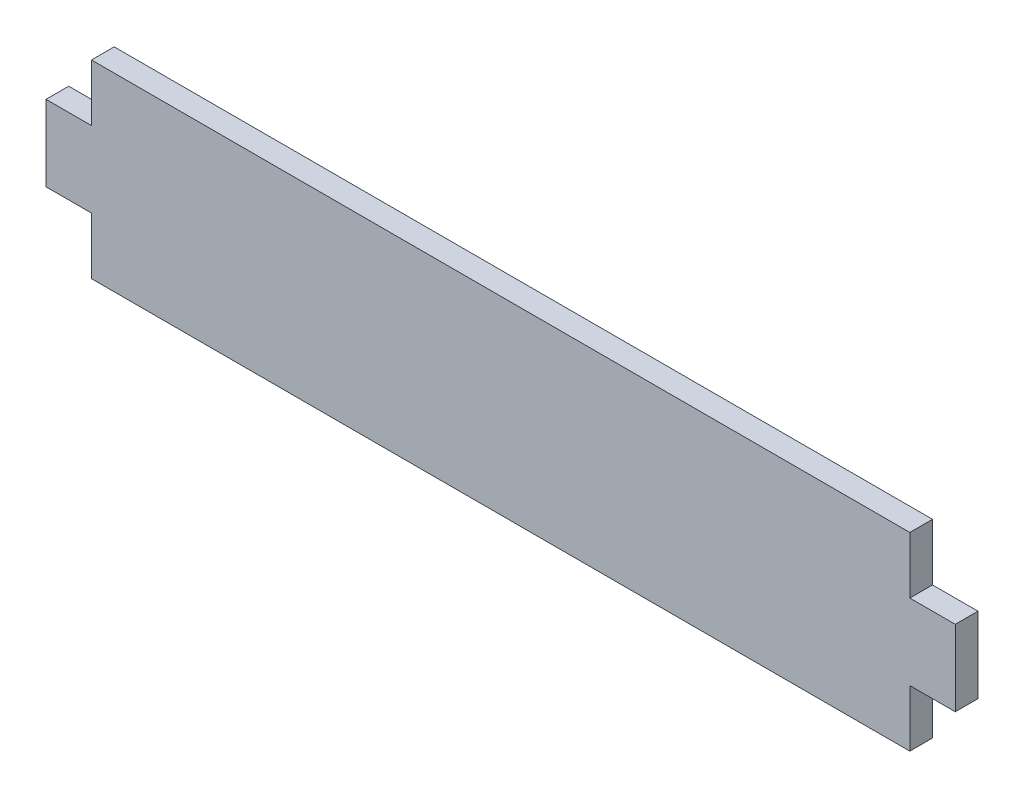
ISO-10303-21;
HEADER;
FILE_DESCRIPTION(('STEP AP214'),'2;1');
FILE_NAME('part.step','',(''),(''),'','','');
FILE_SCHEMA(('AUTOMOTIVE_DESIGN { 1 0 10303 214 1 1 1 1 }'));
ENDSEC;
DATA;
#1=APPLICATION_CONTEXT('core data for automotive mechanical design processes');
#2=APPLICATION_PROTOCOL_DEFINITION('international standard','automotive_design',2000,#1);
#3=PRODUCT_CONTEXT('',#1,'mechanical');
#4=PRODUCT('Part','Part','',(#3));
#5=PRODUCT_RELATED_PRODUCT_CATEGORY('part','',(#4));
#6=PRODUCT_DEFINITION_FORMATION('','',#4);
#7=PRODUCT_DEFINITION_CONTEXT('part definition',#1,'design');
#8=PRODUCT_DEFINITION('design','',#6,#7);
#9=PRODUCT_DEFINITION_SHAPE('','',#8);
#10=(LENGTH_UNIT() NAMED_UNIT(*) SI_UNIT(.MILLI.,.METRE.));
#11=(NAMED_UNIT(*) PLANE_ANGLE_UNIT() SI_UNIT($,.RADIAN.));
#12=(NAMED_UNIT(*) SI_UNIT($,.STERADIAN.) SOLID_ANGLE_UNIT());
#13=UNCERTAINTY_MEASURE_WITH_UNIT(LENGTH_MEASURE(1.E-05),#10,'distance_accuracy_value','');
#14=(GEOMETRIC_REPRESENTATION_CONTEXT(3) GLOBAL_UNCERTAINTY_ASSIGNED_CONTEXT((#13)) GLOBAL_UNIT_ASSIGNED_CONTEXT((#10,
#11,#12)) REPRESENTATION_CONTEXT('',''));
#15=CARTESIAN_POINT('',(0.,0.,0.));
#16=DIRECTION('',(0.,0.,1.));
#17=DIRECTION('',(1.,0.,0.));
#18=AXIS2_PLACEMENT_3D('',#15,#16,#17);
#19=CARTESIAN_POINT('',(-54.,-5.,3.));
#20=DIRECTION('',(1.,0.,0.));
#21=DIRECTION('',(0.,1.,0.));
#22=AXIS2_PLACEMENT_3D('',#19,#20,#21);
#23=PLANE('',#22);
#24=DIRECTION('',(0.,-1.,0.));
#25=VECTOR('',#24,1.);
#26=CARTESIAN_POINT('',(-54.,-5.,0.));
#27=LINE('',#26,#25);
#28=CARTESIAN_POINT('',(-54.,-5.,0.));
#29=VERTEX_POINT('',#28);
#30=CARTESIAN_POINT('',(-54.,-12.5,0.));
#31=VERTEX_POINT('',#30);
#32=EDGE_CURVE('E164',#29,#31,#27,.T.);
#33=ORIENTED_EDGE('',*,*,#32,.T.);
#34=DIRECTION('',(0.,0.,-1.));
#35=VECTOR('',#34,1.);
#36=CARTESIAN_POINT('',(-54.,-12.5,3.));
#37=LINE('',#36,#35);
#38=CARTESIAN_POINT('',(-54.,-12.5,3.));
#39=VERTEX_POINT('',#38);
#40=EDGE_CURVE('E11',#39,#31,#37,.T.);
#41=ORIENTED_EDGE('',*,*,#40,.F.);
#42=DIRECTION('',(0.,-1.,0.));
#43=VECTOR('',#42,1.);
#44=CARTESIAN_POINT('',(-54.,-5.,3.));
#45=LINE('',#44,#43);
#46=CARTESIAN_POINT('',(-54.,-5.,3.));
#47=VERTEX_POINT('',#46);
#48=EDGE_CURVE('E198',#47,#39,#45,.T.);
#49=ORIENTED_EDGE('',*,*,#48,.F.);
#50=DIRECTION('',(0.,0.,-1.));
#51=VECTOR('',#50,1.);
#52=CARTESIAN_POINT('',(-54.,-5.,3.));
#53=LINE('',#52,#51);
#54=EDGE_CURVE('E160',#47,#29,#53,.T.);
#55=ORIENTED_EDGE('',*,*,#54,.T.);
#56=EDGE_LOOP('',(#33,#41,#49,#55));
#57=FACE_BOUND('',#56,.T.);
#58=ADVANCED_FACE('F39',(#57),#23,.F.);
#59=CARTESIAN_POINT('',(54.,-12.5,3.));
#60=DIRECTION('',(0.,1.,0.));
#61=DIRECTION('',(0.,0.,1.));
#62=AXIS2_PLACEMENT_3D('',#59,#60,#61);
#63=PLANE('',#62);
#64=DIRECTION('',(1.,0.,0.));
#65=VECTOR('',#64,1.);
#66=CARTESIAN_POINT('',(54.,-12.5,0.));
#67=LINE('',#66,#65);
#68=CARTESIAN_POINT('',(54.,-12.5,0.));
#69=VERTEX_POINT('',#68);
#70=EDGE_CURVE('E168',#31,#69,#67,.T.);
#71=ORIENTED_EDGE('',*,*,#70,.T.);
#72=DIRECTION('',(0.,0.,-1.));
#73=VECTOR('',#72,1.);
#74=CARTESIAN_POINT('',(54.,-12.5,3.));
#75=LINE('',#74,#73);
#76=CARTESIAN_POINT('',(54.,-12.5,3.));
#77=VERTEX_POINT('',#76);
#78=EDGE_CURVE('E48',#77,#69,#75,.T.);
#79=ORIENTED_EDGE('',*,*,#78,.F.);
#80=DIRECTION('',(1.,0.,0.));
#81=VECTOR('',#80,1.);
#82=CARTESIAN_POINT('',(54.,-12.5,3.));
#83=LINE('',#82,#81);
#84=EDGE_CURVE('E111',#39,#77,#83,.T.);
#85=ORIENTED_EDGE('',*,*,#84,.F.);
#86=ORIENTED_EDGE('',*,*,#40,.T.);
#87=EDGE_LOOP('',(#71,#79,#85,#86));
#88=FACE_BOUND('',#87,.T.);
#89=ADVANCED_FACE('F292',(#88),#63,.F.);
#90=CARTESIAN_POINT('',(54.,-5.,3.));
#91=DIRECTION('',(-1.,0.,0.));
#92=DIRECTION('',(0.,-1.,0.));
#93=AXIS2_PLACEMENT_3D('',#90,#91,#92);
#94=PLANE('',#93);
#95=DIRECTION('',(0.,1.,0.));
#96=VECTOR('',#95,1.);
#97=CARTESIAN_POINT('',(54.,-5.,0.));
#98=LINE('',#97,#96);
#99=CARTESIAN_POINT('',(54.,-5.,0.));
#100=VERTEX_POINT('',#99);
#101=EDGE_CURVE('E171',#69,#100,#98,.T.);
#102=ORIENTED_EDGE('',*,*,#101,.T.);
#103=DIRECTION('',(0.,0.,-1.));
#104=VECTOR('',#103,1.);
#105=CARTESIAN_POINT('',(54.,-5.,3.));
#106=LINE('',#105,#104);
#107=CARTESIAN_POINT('',(54.,-5.,3.));
#108=VERTEX_POINT('',#107);
#109=EDGE_CURVE('E225',#108,#100,#106,.T.);
#110=ORIENTED_EDGE('',*,*,#109,.F.);
#111=DIRECTION('',(0.,1.,0.));
#112=VECTOR('',#111,1.);
#113=CARTESIAN_POINT('',(54.,-5.,3.));
#114=LINE('',#113,#112);
#115=EDGE_CURVE('E235',#77,#108,#114,.T.);
#116=ORIENTED_EDGE('',*,*,#115,.F.);
#117=ORIENTED_EDGE('',*,*,#78,.T.);
#118=EDGE_LOOP('',(#102,#110,#116,#117));
#119=FACE_BOUND('',#118,.T.);
#120=ADVANCED_FACE('F233',(#119),#94,.F.);
#121=CARTESIAN_POINT('',(60.,-5.,3.));
#122=DIRECTION('',(0.,1.,0.));
#123=DIRECTION('',(-1.,0.,0.));
#124=AXIS2_PLACEMENT_3D('',#121,#122,#123);
#125=PLANE('',#124);
#126=DIRECTION('',(1.,0.,0.));
#127=VECTOR('',#126,1.);
#128=CARTESIAN_POINT('',(60.,-5.,0.));
#129=LINE('',#128,#127);
#130=CARTESIAN_POINT('',(60.,-5.,0.));
#131=VERTEX_POINT('',#130);
#132=EDGE_CURVE('E174',#100,#131,#129,.T.);
#133=ORIENTED_EDGE('',*,*,#132,.T.);
#134=DIRECTION('',(0.,0.,-1.));
#135=VECTOR('',#134,1.);
#136=CARTESIAN_POINT('',(60.,-5.,3.));
#137=LINE('',#136,#135);
#138=CARTESIAN_POINT('',(60.,-5.,3.));
#139=VERTEX_POINT('',#138);
#140=EDGE_CURVE('E221',#139,#131,#137,.T.);
#141=ORIENTED_EDGE('',*,*,#140,.F.);
#142=DIRECTION('',(1.,0.,0.));
#143=VECTOR('',#142,1.);
#144=CARTESIAN_POINT('',(60.,-5.,3.));
#145=LINE('',#144,#143);
#146=EDGE_CURVE('E254',#108,#139,#145,.T.);
#147=ORIENTED_EDGE('',*,*,#146,.F.);
#148=ORIENTED_EDGE('',*,*,#109,.T.);
#149=EDGE_LOOP('',(#133,#141,#147,#148));
#150=FACE_BOUND('',#149,.T.);
#151=ADVANCED_FACE('F244',(#150),#125,.F.);
#152=CARTESIAN_POINT('',(60.,5.,3.));
#153=DIRECTION('',(-1.,0.,0.));
#154=DIRECTION('',(0.,0.,1.));
#155=AXIS2_PLACEMENT_3D('',#152,#153,#154);
#156=PLANE('',#155);
#157=DIRECTION('',(0.,1.,0.));
#158=VECTOR('',#157,1.);
#159=CARTESIAN_POINT('',(60.,5.,0.));
#160=LINE('',#159,#158);
#161=CARTESIAN_POINT('',(60.,5.,0.));
#162=VERTEX_POINT('',#161);
#163=EDGE_CURVE('E177',#131,#162,#160,.T.);
#164=ORIENTED_EDGE('',*,*,#163,.T.);
#165=DIRECTION('',(0.,0.,-1.));
#166=VECTOR('',#165,1.);
#167=CARTESIAN_POINT('',(60.,5.,3.));
#168=LINE('',#167,#166);
#169=CARTESIAN_POINT('',(60.,5.,3.));
#170=VERTEX_POINT('',#169);
#171=EDGE_CURVE('E217',#170,#162,#168,.T.);
#172=ORIENTED_EDGE('',*,*,#171,.F.);
#173=DIRECTION('',(0.,1.,0.));
#174=VECTOR('',#173,1.);
#175=CARTESIAN_POINT('',(60.,5.,3.));
#176=LINE('',#175,#174);
#177=EDGE_CURVE('E250',#139,#170,#176,.T.);
#178=ORIENTED_EDGE('',*,*,#177,.F.);
#179=ORIENTED_EDGE('',*,*,#140,.T.);
#180=EDGE_LOOP('',(#164,#172,#178,#179));
#181=FACE_BOUND('',#180,.T.);
#182=ADVANCED_FACE('F248',(#181),#156,.F.);
#183=CARTESIAN_POINT('',(60.,5.,3.));
#184=DIRECTION('',(0.,-1.,0.));
#185=DIRECTION('',(0.,0.,-1.));
#186=AXIS2_PLACEMENT_3D('',#183,#184,#185);
#187=PLANE('',#186);
#188=DIRECTION('',(-1.,0.,0.));
#189=VECTOR('',#188,1.);
#190=CARTESIAN_POINT('',(60.,5.,0.));
#191=LINE('',#190,#189);
#192=CARTESIAN_POINT('',(54.,5.,0.));
#193=VERTEX_POINT('',#192);
#194=EDGE_CURVE('E180',#162,#193,#191,.T.);
#195=ORIENTED_EDGE('',*,*,#194,.T.);
#196=DIRECTION('',(0.,0.,-1.));
#197=VECTOR('',#196,1.);
#198=CARTESIAN_POINT('',(54.,5.,3.));
#199=LINE('',#198,#197);
#200=CARTESIAN_POINT('',(54.,5.,3.));
#201=VERTEX_POINT('',#200);
#202=EDGE_CURVE('E213',#201,#193,#199,.T.);
#203=ORIENTED_EDGE('',*,*,#202,.F.);
#204=DIRECTION('',(-1.,0.,0.));
#205=VECTOR('',#204,1.);
#206=CARTESIAN_POINT('',(60.,5.,3.));
#207=LINE('',#206,#205);
#208=EDGE_CURVE('E253',#170,#201,#207,.T.);
#209=ORIENTED_EDGE('',*,*,#208,.F.);
#210=ORIENTED_EDGE('',*,*,#171,.T.);
#211=EDGE_LOOP('',(#195,#203,#209,#210));
#212=FACE_BOUND('',#211,.T.);
#213=ADVANCED_FACE('F305',(#212),#187,.F.);
#214=CARTESIAN_POINT('',(54.,12.5,3.));
#215=DIRECTION('',(-1.,0.,0.));
#216=DIRECTION('',(0.,0.,1.));
#217=AXIS2_PLACEMENT_3D('',#214,#215,#216);
#218=PLANE('',#217);
#219=DIRECTION('',(0.,1.,0.));
#220=VECTOR('',#219,1.);
#221=CARTESIAN_POINT('',(54.,12.5,0.));
#222=LINE('',#221,#220);
#223=CARTESIAN_POINT('',(54.,12.5,0.));
#224=VERTEX_POINT('',#223);
#225=EDGE_CURVE('E183',#193,#224,#222,.T.);
#226=ORIENTED_EDGE('',*,*,#225,.T.);
#227=DIRECTION('',(0.,0.,-1.));
#228=VECTOR('',#227,1.);
#229=CARTESIAN_POINT('',(54.,12.5,3.));
#230=LINE('',#229,#228);
#231=CARTESIAN_POINT('',(54.,12.5,3.));
#232=VERTEX_POINT('',#231);
#233=EDGE_CURVE('E209',#232,#224,#230,.T.);
#234=ORIENTED_EDGE('',*,*,#233,.F.);
#235=DIRECTION('',(0.,1.,0.));
#236=VECTOR('',#235,1.);
#237=CARTESIAN_POINT('',(54.,12.5,3.));
#238=LINE('',#237,#236);
#239=EDGE_CURVE('E258',#201,#232,#238,.T.);
#240=ORIENTED_EDGE('',*,*,#239,.F.);
#241=ORIENTED_EDGE('',*,*,#202,.T.);
#242=EDGE_LOOP('',(#226,#234,#240,#241));
#243=FACE_BOUND('',#242,.T.);
#244=ADVANCED_FACE('F308',(#243),#218,.F.);
#245=CARTESIAN_POINT('',(54.,12.5,3.));
#246=DIRECTION('',(0.,-1.,0.));
#247=DIRECTION('',(0.,0.,-1.));
#248=AXIS2_PLACEMENT_3D('',#245,#246,#247);
#249=PLANE('',#248);
#250=DIRECTION('',(-1.,0.,0.));
#251=VECTOR('',#250,1.);
#252=CARTESIAN_POINT('',(54.,12.5,0.));
#253=LINE('',#252,#251);
#254=CARTESIAN_POINT('',(-54.,12.5,0.));
#255=VERTEX_POINT('',#254);
#256=EDGE_CURVE('E186',#224,#255,#253,.T.);
#257=ORIENTED_EDGE('',*,*,#256,.T.);
#258=DIRECTION('',(0.,0.,-1.));
#259=VECTOR('',#258,1.);
#260=CARTESIAN_POINT('',(-54.,12.5,3.));
#261=LINE('',#260,#259);
#262=CARTESIAN_POINT('',(-54.,12.5,3.));
#263=VERTEX_POINT('',#262);
#264=EDGE_CURVE('E205',#263,#255,#261,.T.);
#265=ORIENTED_EDGE('',*,*,#264,.F.);
#266=DIRECTION('',(-1.,0.,0.));
#267=VECTOR('',#266,1.);
#268=CARTESIAN_POINT('',(54.,12.5,3.));
#269=LINE('',#268,#267);
#270=EDGE_CURVE('E265',#232,#263,#269,.T.);
#271=ORIENTED_EDGE('',*,*,#270,.F.);
#272=ORIENTED_EDGE('',*,*,#233,.T.);
#273=EDGE_LOOP('',(#257,#265,#271,#272));
#274=FACE_BOUND('',#273,.T.);
#275=ADVANCED_FACE('F273',(#274),#249,.F.);
#276=CARTESIAN_POINT('',(-54.,12.5,3.));
#277=DIRECTION('',(1.,0.,0.));
#278=DIRECTION('',(0.,0.,-1.));
#279=AXIS2_PLACEMENT_3D('',#276,#277,#278);
#280=PLANE('',#279);
#281=DIRECTION('',(0.,-1.,0.));
#282=VECTOR('',#281,1.);
#283=CARTESIAN_POINT('',(-54.,12.5,0.));
#284=LINE('',#283,#282);
#285=CARTESIAN_POINT('',(-54.,5.,0.));
#286=VERTEX_POINT('',#285);
#287=EDGE_CURVE('E189',#255,#286,#284,.T.);
#288=ORIENTED_EDGE('',*,*,#287,.T.);
#289=DIRECTION('',(0.,0.,-1.));
#290=VECTOR('',#289,1.);
#291=CARTESIAN_POINT('',(-54.,5.,3.));
#292=LINE('',#291,#290);
#293=CARTESIAN_POINT('',(-54.,5.,3.));
#294=VERTEX_POINT('',#293);
#295=EDGE_CURVE('E153',#294,#286,#292,.T.);
#296=ORIENTED_EDGE('',*,*,#295,.F.);
#297=DIRECTION('',(0.,-1.,0.));
#298=VECTOR('',#297,1.);
#299=CARTESIAN_POINT('',(-54.,12.5,3.));
#300=LINE('',#299,#298);
#301=EDGE_CURVE('E142',#263,#294,#300,.T.);
#302=ORIENTED_EDGE('',*,*,#301,.F.);
#303=ORIENTED_EDGE('',*,*,#264,.T.);
#304=EDGE_LOOP('',(#288,#296,#302,#303));
#305=FACE_BOUND('',#304,.T.);
#306=ADVANCED_FACE('F277',(#305),#280,.F.);
#307=CARTESIAN_POINT('',(-60.,5.,3.));
#308=DIRECTION('',(0.,-1.,0.));
#309=DIRECTION('',(0.,0.,-1.));
#310=AXIS2_PLACEMENT_3D('',#307,#308,#309);
#311=PLANE('',#310);
#312=DIRECTION('',(-1.,0.,0.));
#313=VECTOR('',#312,1.);
#314=CARTESIAN_POINT('',(-60.,5.,0.));
#315=LINE('',#314,#313);
#316=CARTESIAN_POINT('',(-60.,5.,0.));
#317=VERTEX_POINT('',#316);
#318=EDGE_CURVE('E151',#286,#317,#315,.T.);
#319=ORIENTED_EDGE('',*,*,#318,.T.);
#320=DIRECTION('',(0.,0.,-1.));
#321=VECTOR('',#320,1.);
#322=CARTESIAN_POINT('',(-60.,5.,3.));
#323=LINE('',#322,#321);
#324=CARTESIAN_POINT('',(-60.,5.,3.));
#325=VERTEX_POINT('',#324);
#326=EDGE_CURVE('E148',#325,#317,#323,.T.);
#327=ORIENTED_EDGE('',*,*,#326,.F.);
#328=DIRECTION('',(-1.,0.,0.));
#329=VECTOR('',#328,1.);
#330=CARTESIAN_POINT('',(-60.,5.,3.));
#331=LINE('',#330,#329);
#332=EDGE_CURVE('E136',#294,#325,#331,.T.);
#333=ORIENTED_EDGE('',*,*,#332,.F.);
#334=ORIENTED_EDGE('',*,*,#295,.T.);
#335=EDGE_LOOP('',(#319,#327,#333,#334));
#336=FACE_BOUND('',#335,.T.);
#337=ADVANCED_FACE('F149',(#336),#311,.F.);
#338=CARTESIAN_POINT('',(-60.,5.,3.));
#339=DIRECTION('',(1.,0.,0.));
#340=DIRECTION('',(0.,0.,-1.));
#341=AXIS2_PLACEMENT_3D('',#338,#339,#340);
#342=PLANE('',#341);
#343=DIRECTION('',(0.,-1.,0.));
#344=VECTOR('',#343,1.);
#345=CARTESIAN_POINT('',(-60.,5.,0.));
#346=LINE('',#345,#344);
#347=CARTESIAN_POINT('',(-60.,-5.,0.));
#348=VERTEX_POINT('',#347);
#349=EDGE_CURVE('E97',#317,#348,#346,.T.);
#350=ORIENTED_EDGE('',*,*,#349,.T.);
#351=DIRECTION('',(0.,0.,-1.));
#352=VECTOR('',#351,1.);
#353=CARTESIAN_POINT('',(-60.,-5.,3.));
#354=LINE('',#353,#352);
#355=CARTESIAN_POINT('',(-60.,-5.,3.));
#356=VERTEX_POINT('',#355);
#357=EDGE_CURVE('E154',#356,#348,#354,.T.);
#358=ORIENTED_EDGE('',*,*,#357,.F.);
#359=DIRECTION('',(0.,-1.,0.));
#360=VECTOR('',#359,1.);
#361=CARTESIAN_POINT('',(-60.,5.,3.));
#362=LINE('',#361,#360);
#363=EDGE_CURVE('E140',#325,#356,#362,.T.);
#364=ORIENTED_EDGE('',*,*,#363,.F.);
#365=ORIENTED_EDGE('',*,*,#326,.T.);
#366=EDGE_LOOP('',(#350,#358,#364,#365));
#367=FACE_BOUND('',#366,.T.);
#368=ADVANCED_FACE('F156',(#367),#342,.F.);
#369=CARTESIAN_POINT('',(-60.,-5.,3.));
#370=DIRECTION('',(0.,1.,0.));
#371=DIRECTION('',(-1.,0.,0.));
#372=AXIS2_PLACEMENT_3D('',#369,#370,#371);
#373=PLANE('',#372);
#374=DIRECTION('',(1.,0.,0.));
#375=VECTOR('',#374,1.);
#376=CARTESIAN_POINT('',(-60.,-5.,0.));
#377=LINE('',#376,#375);
#378=EDGE_CURVE('E103',#348,#29,#377,.T.);
#379=ORIENTED_EDGE('',*,*,#378,.T.);
#380=ORIENTED_EDGE('',*,*,#54,.F.);
#381=DIRECTION('',(1.,0.,0.));
#382=VECTOR('',#381,1.);
#383=CARTESIAN_POINT('',(-60.,-5.,3.));
#384=LINE('',#383,#382);
#385=EDGE_CURVE('E56',#356,#47,#384,.T.);
#386=ORIENTED_EDGE('',*,*,#385,.F.);
#387=ORIENTED_EDGE('',*,*,#357,.T.);
#388=EDGE_LOOP('',(#379,#380,#386,#387));
#389=FACE_BOUND('',#388,.T.);
#390=ADVANCED_FACE('F281',(#389),#373,.F.);
#391=CARTESIAN_POINT('',(0.,0.,3.));
#392=DIRECTION('',(0.,0.,-1.));
#393=DIRECTION('',(-1.,0.,0.));
#394=AXIS2_PLACEMENT_3D('',#391,#392,#393);
#395=PLANE('',#394);
#396=ORIENTED_EDGE('',*,*,#48,.T.);
#397=ORIENTED_EDGE('',*,*,#84,.T.);
#398=ORIENTED_EDGE('',*,*,#115,.T.);
#399=ORIENTED_EDGE('',*,*,#146,.T.);
#400=ORIENTED_EDGE('',*,*,#177,.T.);
#401=ORIENTED_EDGE('',*,*,#208,.T.);
#402=ORIENTED_EDGE('',*,*,#239,.T.);
#403=ORIENTED_EDGE('',*,*,#270,.T.);
#404=ORIENTED_EDGE('',*,*,#301,.T.);
#405=ORIENTED_EDGE('',*,*,#332,.T.);
#406=ORIENTED_EDGE('',*,*,#363,.T.);
#407=ORIENTED_EDGE('',*,*,#385,.T.);
#408=EDGE_LOOP('',(#396,#397,#398,#399,#400,#401,#402,#403,#404,#405,#406,#407));
#409=FACE_BOUND('',#408,.T.);
#410=ADVANCED_FACE('F138',(#409),#395,.F.);
#411=CARTESIAN_POINT('',(0.,0.,0.));
#412=DIRECTION('',(0.,0.,-1.));
#413=DIRECTION('',(-1.,0.,0.));
#414=AXIS2_PLACEMENT_3D('',#411,#412,#413);
#415=PLANE('',#414);
#416=ORIENTED_EDGE('',*,*,#32,.F.);
#417=ORIENTED_EDGE('',*,*,#378,.F.);
#418=ORIENTED_EDGE('',*,*,#349,.F.);
#419=ORIENTED_EDGE('',*,*,#318,.F.);
#420=ORIENTED_EDGE('',*,*,#287,.F.);
#421=ORIENTED_EDGE('',*,*,#256,.F.);
#422=ORIENTED_EDGE('',*,*,#225,.F.);
#423=ORIENTED_EDGE('',*,*,#194,.F.);
#424=ORIENTED_EDGE('',*,*,#163,.F.);
#425=ORIENTED_EDGE('',*,*,#132,.F.);
#426=ORIENTED_EDGE('',*,*,#101,.F.);
#427=ORIENTED_EDGE('',*,*,#70,.F.);
#428=EDGE_LOOP('',(#416,#417,#418,#419,#420,#421,#422,#423,#424,#425,#426,#427));
#429=FACE_BOUND('',#428,.T.);
#430=ADVANCED_FACE('F239',(#429),#415,.T.);
#431=CLOSED_SHELL('',(#58,#89,#120,#151,#182,#213,#244,#275,#306,#337,#368,#390,#410,#430));
#432=MANIFOLD_SOLID_BREP('B2',#431);
#433=ADVANCED_BREP_SHAPE_REPRESENTATION('',(#18,#432),#14);
#434=SHAPE_DEFINITION_REPRESENTATION(#9,#433);
ENDSEC;
END-ISO-10303-21;
